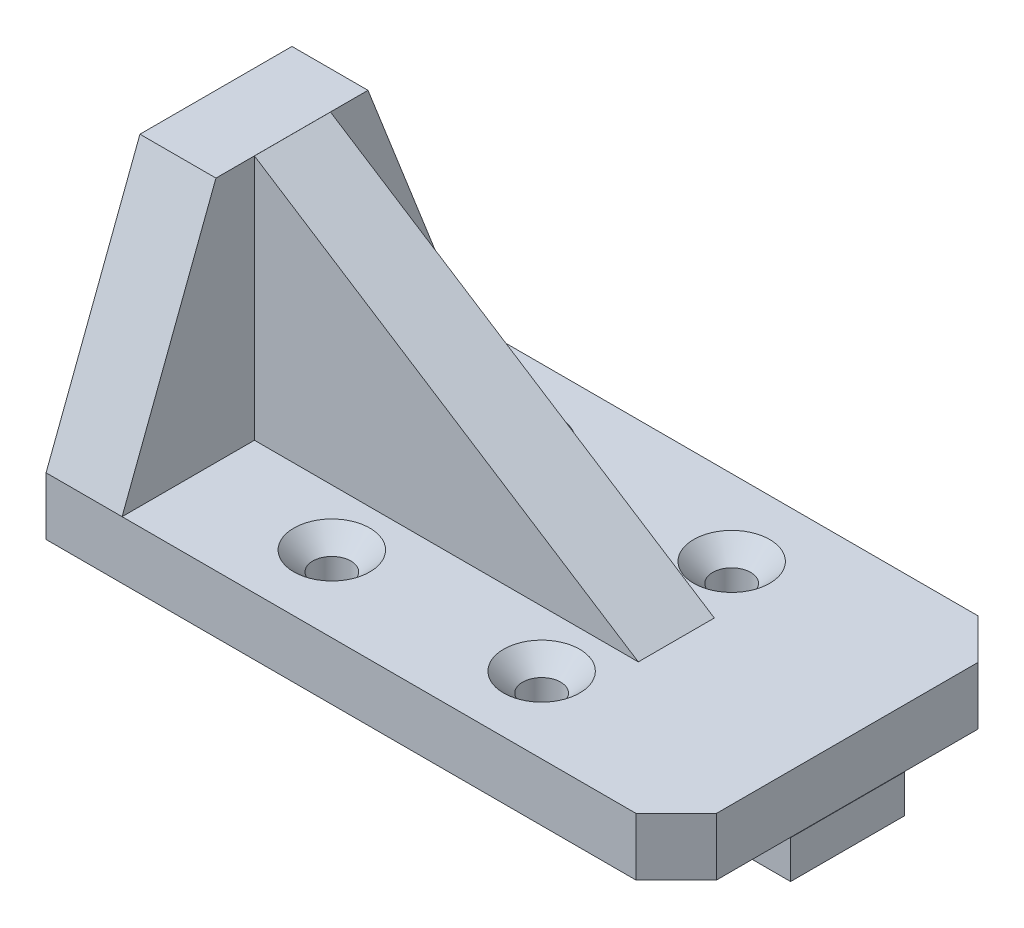
ISO-10303-21;
HEADER;
FILE_DESCRIPTION(('STEP AP214'),'2;1');
FILE_NAME('part.step','',(''),(''),'','','');
FILE_SCHEMA(('AUTOMOTIVE_DESIGN { 1 0 10303 214 1 1 1 1 }'));
ENDSEC;
DATA;
#1=APPLICATION_CONTEXT('core data for automotive mechanical design processes');
#2=APPLICATION_PROTOCOL_DEFINITION('international standard','automotive_design',2000,#1);
#3=PRODUCT_CONTEXT('',#1,'mechanical');
#4=PRODUCT('Part','Part','',(#3));
#5=PRODUCT_RELATED_PRODUCT_CATEGORY('part','',(#4));
#6=PRODUCT_DEFINITION_FORMATION('','',#4);
#7=PRODUCT_DEFINITION_CONTEXT('part definition',#1,'design');
#8=PRODUCT_DEFINITION('design','',#6,#7);
#9=PRODUCT_DEFINITION_SHAPE('','',#8);
#10=(LENGTH_UNIT() NAMED_UNIT(*) SI_UNIT(.MILLI.,.METRE.));
#11=(NAMED_UNIT(*) PLANE_ANGLE_UNIT() SI_UNIT($,.RADIAN.));
#12=(NAMED_UNIT(*) SI_UNIT($,.STERADIAN.) SOLID_ANGLE_UNIT());
#13=UNCERTAINTY_MEASURE_WITH_UNIT(LENGTH_MEASURE(1.E-05),#10,'distance_accuracy_value','');
#14=(GEOMETRIC_REPRESENTATION_CONTEXT(3) GLOBAL_UNCERTAINTY_ASSIGNED_CONTEXT((#13)) GLOBAL_UNIT_ASSIGNED_CONTEXT((#10,
#11,#12)) REPRESENTATION_CONTEXT('',''));
#15=CARTESIAN_POINT('',(0.,0.,0.));
#16=DIRECTION('',(0.,0.,1.));
#17=DIRECTION('',(1.,0.,0.));
#18=AXIS2_PLACEMENT_3D('',#15,#16,#17);
#19=CARTESIAN_POINT('',(0.,0.,0.));
#20=DIRECTION('',(0.,1.,0.));
#21=DIRECTION('',(0.,0.,1.));
#22=AXIS2_PLACEMENT_3D('',#19,#20,#21);
#23=PLANE('',#22);
#24=DIRECTION('',(-1.,0.,0.));
#25=VECTOR('',#24,1.);
#26=CARTESIAN_POINT('',(0.,0.,55.8942781690141));
#27=LINE('',#26,#25);
#28=CARTESIAN_POINT('',(-1.778,0.,55.8942781690141));
#29=VERTEX_POINT('',#28);
#30=CARTESIAN_POINT('',(-1.79049295774648,0.,55.8942781690141));
#31=VERTEX_POINT('',#30);
#32=EDGE_CURVE('E345',#29,#31,#27,.T.);
#33=ORIENTED_EDGE('',*,*,#32,.F.);
#34=DIRECTION('',(0.,0.,-1.));
#35=VECTOR('',#34,1.);
#36=CARTESIAN_POINT('',(-1.778,0.,55.8942781690141));
#37=LINE('',#36,#35);
#38=CARTESIAN_POINT('',(-1.778,0.,-1.25572183098592));
#39=VERTEX_POINT('',#38);
#40=EDGE_CURVE('E63',#29,#39,#37,.T.);
#41=ORIENTED_EDGE('',*,*,#40,.T.);
#42=DIRECTION('',(1.,0.,0.));
#43=VECTOR('',#42,1.);
#44=CARTESIAN_POINT('',(0.,0.,-1.25572183098592));
#45=LINE('',#44,#43);
#46=CARTESIAN_POINT('',(-1.79049295774648,0.,-1.25572183098592));
#47=VERTEX_POINT('',#46);
#48=EDGE_CURVE('E307',#47,#39,#45,.T.);
#49=ORIENTED_EDGE('',*,*,#48,.F.);
#50=DIRECTION('',(0.,0.,-1.));
#51=VECTOR('',#50,1.);
#52=CARTESIAN_POINT('',(-1.79049295774648,0.,0.));
#53=LINE('',#52,#51);
#54=EDGE_CURVE('E301',#31,#47,#53,.T.);
#55=ORIENTED_EDGE('',*,*,#54,.F.);
#56=EDGE_LOOP('',(#33,#41,#49,#55));
#57=FACE_BOUND('',#56,.T.);
#58=ADVANCED_FACE('F39',(#57),#23,.T.);
#59=DIRECTION('',(0.,0.,-1.));
#60=VECTOR('',#59,1.);
#61=CARTESIAN_POINT('',(10.922,0.,55.8942781690141));
#62=LINE('',#61,#60);
#63=CARTESIAN_POINT('',(10.922,0.,55.8942781690141));
#64=VERTEX_POINT('',#63);
#65=CARTESIAN_POINT('',(10.922,0.,33.782));
#66=VERTEX_POINT('',#65);
#67=EDGE_CURVE('E408',#64,#66,#62,.T.);
#68=ORIENTED_EDGE('',*,*,#67,.F.);
#69=CARTESIAN_POINT('',(96.7615070422536,0.,55.8942781690141));
#70=VERTEX_POINT('',#69);
#71=EDGE_CURVE('E346',#70,#64,#27,.T.);
#72=ORIENTED_EDGE('',*,*,#71,.F.);
#73=DIRECTION('',(-0.707106781186551,0.,0.707106781186544));
#74=VECTOR('',#73,1.);
#75=CARTESIAN_POINT('',(76.3278926056333,0.,76.3278926056341));
#76=LINE('',#75,#74);
#77=CARTESIAN_POINT('',(103.496699133055,0.,49.1590860782123));
#78=VERTEX_POINT('',#77);
#79=EDGE_CURVE('E350',#78,#70,#76,.T.);
#80=ORIENTED_EDGE('',*,*,#79,.F.);
#81=DIRECTION('',(0.,0.,1.));
#82=VECTOR('',#81,1.);
#83=CARTESIAN_POINT('',(103.496699133055,0.,0.));
#84=LINE('',#83,#82);
#85=CARTESIAN_POINT('',(103.496699133055,0.,5.47947025981595));
#86=VERTEX_POINT('',#85);
#87=EDGE_CURVE('E353',#86,#78,#84,.T.);
#88=ORIENTED_EDGE('',*,*,#87,.F.);
#89=DIRECTION('',(0.707106781186548,0.,0.707106781186548));
#90=VECTOR('',#89,1.);
#91=CARTESIAN_POINT('',(49.0086144366197,0.,-49.0086144366197));
#92=LINE('',#91,#90);
#93=CARTESIAN_POINT('',(96.7615070422535,0.,-1.25572183098591));
#94=VERTEX_POINT('',#93);
#95=EDGE_CURVE('E356',#94,#86,#92,.T.);
#96=ORIENTED_EDGE('',*,*,#95,.F.);
#97=CARTESIAN_POINT('',(10.922,0.,-1.25572183098592));
#98=VERTEX_POINT('',#97);
#99=EDGE_CURVE('E55',#98,#94,#45,.T.);
#100=ORIENTED_EDGE('',*,*,#99,.F.);
#101=CARTESIAN_POINT('',(10.922,0.,21.082));
#102=VERTEX_POINT('',#101);
#103=EDGE_CURVE('E185',#102,#98,#62,.T.);
#104=ORIENTED_EDGE('',*,*,#103,.F.);
#105=DIRECTION('',(1.,0.,0.));
#106=VECTOR('',#105,1.);
#107=CARTESIAN_POINT('',(75.0486991330554,0.,21.082));
#108=LINE('',#107,#106);
#109=CARTESIAN_POINT('',(75.0486991330554,0.,21.082));
#110=VERTEX_POINT('',#109);
#111=EDGE_CURVE('E206',#102,#110,#108,.T.);
#112=ORIENTED_EDGE('',*,*,#111,.T.);
#113=DIRECTION('',(0.,0.,-1.));
#114=VECTOR('',#113,1.);
#115=CARTESIAN_POINT('',(75.0486991330554,0.,33.782));
#116=LINE('',#115,#114);
#117=CARTESIAN_POINT('',(75.0486991330554,0.,33.782));
#118=VERTEX_POINT('',#117);
#119=EDGE_CURVE('E215',#118,#110,#116,.T.);
#120=ORIENTED_EDGE('',*,*,#119,.F.);
#121=DIRECTION('',(1.,0.,0.));
#122=VECTOR('',#121,1.);
#123=CARTESIAN_POINT('',(75.0486991330554,0.,33.782));
#124=LINE('',#123,#122);
#125=EDGE_CURVE('E207',#66,#118,#124,.T.);
#126=ORIENTED_EDGE('',*,*,#125,.F.);
#127=EDGE_LOOP('',(#68,#72,#80,#88,#96,#100,#104,#112,#120,#126));
#128=FACE_BOUND('',#127,.T.);
#129=CARTESIAN_POINT('',(68.3135070422535,0.,11.4442781690141));
#130=DIRECTION('',(0.,1.,0.));
#131=DIRECTION('',(0.,0.,1.));
#132=AXIS2_PLACEMENT_3D('',#129,#130,#131);
#133=CIRCLE('',#132,6.35);
#134=CARTESIAN_POINT('',(68.3135070422535,0.,17.7942781690141));
#135=VERTEX_POINT('',#134);
#136=EDGE_CURVE('E269',#135,#135,#133,.T.);
#137=ORIENTED_EDGE('',*,*,#136,.F.);
#138=EDGE_LOOP('',(#137));
#139=FACE_BOUND('',#138,.T.);
#140=CARTESIAN_POINT('',(33.2615070422535,0.,11.4442781690141));
#141=DIRECTION('',(0.,1.,0.));
#142=DIRECTION('',(0.,0.,1.));
#143=AXIS2_PLACEMENT_3D('',#140,#141,#142);
#144=CIRCLE('',#143,6.35);
#145=CARTESIAN_POINT('',(33.2615070422535,0.,17.7942781690141));
#146=VERTEX_POINT('',#145);
#147=EDGE_CURVE('E275',#146,#146,#144,.T.);
#148=ORIENTED_EDGE('',*,*,#147,.F.);
#149=EDGE_LOOP('',(#148));
#150=FACE_BOUND('',#149,.T.);
#151=CARTESIAN_POINT('',(33.2615070422535,0.,43.1942781690141));
#152=DIRECTION('',(0.,1.,0.));
#153=DIRECTION('',(0.,0.,1.));
#154=AXIS2_PLACEMENT_3D('',#151,#152,#153);
#155=CIRCLE('',#154,6.35);
#156=CARTESIAN_POINT('',(33.2615070422535,0.,49.5442781690141));
#157=VERTEX_POINT('',#156);
#158=EDGE_CURVE('E270',#157,#157,#155,.T.);
#159=ORIENTED_EDGE('',*,*,#158,.F.);
#160=EDGE_LOOP('',(#159));
#161=FACE_BOUND('',#160,.T.);
#162=CARTESIAN_POINT('',(68.3135070422535,0.,43.194278169014));
#163=DIRECTION('',(0.,1.,0.));
#164=DIRECTION('',(0.,0.,1.));
#165=AXIS2_PLACEMENT_3D('',#162,#163,#164);
#166=CIRCLE('',#165,6.35);
#167=CARTESIAN_POINT('',(68.3135070422535,0.,49.544278169014));
#168=VERTEX_POINT('',#167);
#169=EDGE_CURVE('E274',#168,#168,#166,.T.);
#170=ORIENTED_EDGE('',*,*,#169,.F.);
#171=EDGE_LOOP('',(#170));
#172=FACE_BOUND('',#171,.T.);
#173=ADVANCED_FACE('F403',(#128,#139,#150,#161,#172),#23,.T.);
#174=CARTESIAN_POINT('',(0.,-9.652,0.));
#175=DIRECTION('',(0.,1.,0.));
#176=DIRECTION('',(0.,0.,1.));
#177=AXIS2_PLACEMENT_3D('',#174,#175,#176);
#178=PLANE('',#177);
#179=CARTESIAN_POINT('',(68.3135070422535,-9.652,43.194278169014));
#180=DIRECTION('',(0.,1.,0.));
#181=DIRECTION('',(0.,0.,1.));
#182=AXIS2_PLACEMENT_3D('',#179,#180,#181);
#183=CIRCLE('',#182,3.175);
#184=CARTESIAN_POINT('',(68.3135070422535,-9.652,46.369278169014));
#185=VERTEX_POINT('',#184);
#186=EDGE_CURVE('E337',#185,#185,#183,.T.);
#187=ORIENTED_EDGE('',*,*,#186,.T.);
#188=EDGE_LOOP('',(#187));
#189=FACE_BOUND('',#188,.T.);
#190=CARTESIAN_POINT('',(33.2615070422535,-9.652,43.1942781690141));
#191=DIRECTION('',(0.,1.,0.));
#192=DIRECTION('',(0.,0.,1.));
#193=AXIS2_PLACEMENT_3D('',#190,#191,#192);
#194=CIRCLE('',#193,3.175);
#195=CARTESIAN_POINT('',(33.2615070422535,-9.652,46.3692781690141));
#196=VERTEX_POINT('',#195);
#197=EDGE_CURVE('E333',#196,#196,#194,.T.);
#198=ORIENTED_EDGE('',*,*,#197,.T.);
#199=EDGE_LOOP('',(#198));
#200=FACE_BOUND('',#199,.T.);
#201=CARTESIAN_POINT('',(68.3135070422535,-9.652,11.4442781690141));
#202=DIRECTION('',(0.,1.,0.));
#203=DIRECTION('',(0.,0.,1.));
#204=AXIS2_PLACEMENT_3D('',#201,#202,#203);
#205=CIRCLE('',#204,3.175);
#206=CARTESIAN_POINT('',(68.3135070422535,-9.652,14.6192781690141));
#207=VERTEX_POINT('',#206);
#208=EDGE_CURVE('E329',#207,#207,#205,.T.);
#209=ORIENTED_EDGE('',*,*,#208,.T.);
#210=EDGE_LOOP('',(#209));
#211=FACE_BOUND('',#210,.T.);
#212=CARTESIAN_POINT('',(33.2615070422535,-9.652,11.4442781690141));
#213=DIRECTION('',(0.,1.,0.));
#214=DIRECTION('',(0.,0.,1.));
#215=AXIS2_PLACEMENT_3D('',#212,#213,#214);
#216=CIRCLE('',#215,3.175);
#217=CARTESIAN_POINT('',(33.2615070422535,-9.652,14.6192781690141));
#218=VERTEX_POINT('',#217);
#219=EDGE_CURVE('E325',#218,#218,#216,.T.);
#220=ORIENTED_EDGE('',*,*,#219,.T.);
#221=EDGE_LOOP('',(#220));
#222=FACE_BOUND('',#221,.T.);
#223=DIRECTION('',(-1.,0.,0.));
#224=VECTOR('',#223,1.);
#225=CARTESIAN_POINT('',(103.55569205,-9.652,36.8442781690141));
#226=LINE('',#225,#224);
#227=CARTESIAN_POINT('',(103.496699133055,-9.652,36.8442781690141));
#228=VERTEX_POINT('',#227);
#229=CARTESIAN_POINT('',(-1.778,-9.652,36.8442781690141));
#230=VERTEX_POINT('',#229);
#231=EDGE_CURVE('E48',#228,#230,#226,.T.);
#232=ORIENTED_EDGE('',*,*,#231,.F.);
#233=DIRECTION('',(0.,0.,1.));
#234=VECTOR('',#233,1.);
#235=CARTESIAN_POINT('',(103.496699133055,-9.652,0.));
#236=LINE('',#235,#234);
#237=CARTESIAN_POINT('',(103.496699133055,-9.652,49.1590860782123));
#238=VERTEX_POINT('',#237);
#239=EDGE_CURVE('E313',#228,#238,#236,.T.);
#240=ORIENTED_EDGE('',*,*,#239,.T.);
#241=DIRECTION('',(-0.707106781186551,0.,0.707106781186544));
#242=VECTOR('',#241,1.);
#243=CARTESIAN_POINT('',(76.3278926056333,-9.652,76.3278926056341));
#244=LINE('',#243,#242);
#245=CARTESIAN_POINT('',(96.7615070422536,-9.652,55.8942781690141));
#246=VERTEX_POINT('',#245);
#247=EDGE_CURVE('E310',#238,#246,#244,.T.);
#248=ORIENTED_EDGE('',*,*,#247,.T.);
#249=DIRECTION('',(-1.,0.,0.));
#250=VECTOR('',#249,1.);
#251=CARTESIAN_POINT('',(0.,-9.652,55.8942781690141));
#252=LINE('',#251,#250);
#253=CARTESIAN_POINT('',(-1.79049295774648,-9.652,55.8942781690141));
#254=VERTEX_POINT('',#253);
#255=EDGE_CURVE('E306',#246,#254,#252,.T.);
#256=ORIENTED_EDGE('',*,*,#255,.T.);
#257=DIRECTION('',(0.,0.,-1.));
#258=VECTOR('',#257,1.);
#259=CARTESIAN_POINT('',(-1.79049295774648,-9.652,0.));
#260=LINE('',#259,#258);
#261=CARTESIAN_POINT('',(-1.79049295774648,-9.652,-1.25572183098592));
#262=VERTEX_POINT('',#261);
#263=EDGE_CURVE('E302',#254,#262,#260,.T.);
#264=ORIENTED_EDGE('',*,*,#263,.T.);
#265=DIRECTION('',(1.,0.,0.));
#266=VECTOR('',#265,1.);
#267=CARTESIAN_POINT('',(0.,-9.652,-1.25572183098592));
#268=LINE('',#267,#266);
#269=CARTESIAN_POINT('',(96.7615070422535,-9.652,-1.25572183098591));
#270=VERTEX_POINT('',#269);
#271=EDGE_CURVE('E322',#262,#270,#268,.T.);
#272=ORIENTED_EDGE('',*,*,#271,.T.);
#273=DIRECTION('',(0.707106781186548,0.,0.707106781186548));
#274=VECTOR('',#273,1.);
#275=CARTESIAN_POINT('',(49.0086144366197,-9.652,-49.0086144366197));
#276=LINE('',#275,#274);
#277=CARTESIAN_POINT('',(103.496699133055,-9.652,5.47947025981595));
#278=VERTEX_POINT('',#277);
#279=EDGE_CURVE('E318',#270,#278,#276,.T.);
#280=ORIENTED_EDGE('',*,*,#279,.T.);
#281=CARTESIAN_POINT('',(103.496699133055,-9.652,17.7942781690141));
#282=VERTEX_POINT('',#281);
#283=EDGE_CURVE('E314',#278,#282,#236,.T.);
#284=ORIENTED_EDGE('',*,*,#283,.T.);
#285=DIRECTION('',(-1.,0.,0.));
#286=VECTOR('',#285,1.);
#287=CARTESIAN_POINT('',(103.55569205,-9.652,17.7942781690141));
#288=LINE('',#287,#286);
#289=CARTESIAN_POINT('',(-1.778,-9.652,17.7942781690141));
#290=VERTEX_POINT('',#289);
#291=EDGE_CURVE('E261',#282,#290,#288,.T.);
#292=ORIENTED_EDGE('',*,*,#291,.T.);
#293=DIRECTION('',(0.,0.,1.));
#294=VECTOR('',#293,1.);
#295=CARTESIAN_POINT('',(-1.778,-9.652,36.8442781690141));
#296=LINE('',#295,#294);
#297=EDGE_CURVE('E230',#290,#230,#296,.T.);
#298=ORIENTED_EDGE('',*,*,#297,.T.);
#299=EDGE_LOOP('',(#232,#240,#248,#256,#264,#272,#280,#284,#292,#298));
#300=FACE_BOUND('',#299,.T.);
#301=ADVANCED_FACE('F396',(#189,#200,#211,#222,#300),#178,.F.);
#302=CARTESIAN_POINT('',(-1.79049295774648,-9.652,0.));
#303=DIRECTION('',(1.,0.,0.));
#304=DIRECTION('',(0.,0.,-1.));
#305=AXIS2_PLACEMENT_3D('',#302,#303,#304);
#306=PLANE('',#305);
#307=ORIENTED_EDGE('',*,*,#54,.T.);
#308=DIRECTION('',(0.,1.,0.));
#309=VECTOR('',#308,1.);
#310=CARTESIAN_POINT('',(-1.79049295774648,-9.652,-1.25572183098592));
#311=LINE('',#310,#309);
#312=EDGE_CURVE('E361',#262,#47,#311,.T.);
#313=ORIENTED_EDGE('',*,*,#312,.F.);
#314=ORIENTED_EDGE('',*,*,#263,.F.);
#315=DIRECTION('',(0.,1.,0.));
#316=VECTOR('',#315,1.);
#317=CARTESIAN_POINT('',(-1.79049295774648,-9.652,55.8942781690141));
#318=LINE('',#317,#316);
#319=EDGE_CURVE('E341',#254,#31,#318,.T.);
#320=ORIENTED_EDGE('',*,*,#319,.T.);
#321=EDGE_LOOP('',(#307,#313,#314,#320));
#322=FACE_BOUND('',#321,.T.);
#323=ADVANCED_FACE('F41',(#322),#306,.F.);
#324=CARTESIAN_POINT('',(0.,-9.652,-1.25572183098592));
#325=DIRECTION('',(0.,0.,1.));
#326=DIRECTION('',(1.,0.,0.));
#327=AXIS2_PLACEMENT_3D('',#324,#325,#326);
#328=PLANE('',#327);
#329=ORIENTED_EDGE('',*,*,#48,.T.);
#330=DIRECTION('',(-1.,0.,0.));
#331=VECTOR('',#330,1.);
#332=CARTESIAN_POINT('',(10.922,0.,-1.25572183098592));
#333=LINE('',#332,#331);
#334=EDGE_CURVE('E411',#98,#39,#333,.T.);
#335=ORIENTED_EDGE('',*,*,#334,.F.);
#336=ORIENTED_EDGE('',*,*,#99,.T.);
#337=DIRECTION('',(0.,1.,0.));
#338=VECTOR('',#337,1.);
#339=CARTESIAN_POINT('',(96.7615070422535,-9.652,-1.25572183098591));
#340=LINE('',#339,#338);
#341=EDGE_CURVE('E365',#270,#94,#340,.T.);
#342=ORIENTED_EDGE('',*,*,#341,.F.);
#343=ORIENTED_EDGE('',*,*,#271,.F.);
#344=ORIENTED_EDGE('',*,*,#312,.T.);
#345=EDGE_LOOP('',(#329,#335,#336,#342,#343,#344));
#346=FACE_BOUND('',#345,.T.);
#347=ADVANCED_FACE('F391',(#346),#328,.F.);
#348=CARTESIAN_POINT('',(49.0086144366197,-9.652,-49.0086144366197));
#349=DIRECTION('',(-0.707106781186547,0.,0.707106781186547));
#350=DIRECTION('',(0.707106781186548,0.,0.707106781186548));
#351=AXIS2_PLACEMENT_3D('',#348,#349,#350);
#352=PLANE('',#351);
#353=ORIENTED_EDGE('',*,*,#95,.T.);
#354=DIRECTION('',(0.,1.,0.));
#355=VECTOR('',#354,1.);
#356=CARTESIAN_POINT('',(103.496699133055,-9.652,5.47947025981595));
#357=LINE('',#356,#355);
#358=EDGE_CURVE('E369',#278,#86,#357,.T.);
#359=ORIENTED_EDGE('',*,*,#358,.F.);
#360=ORIENTED_EDGE('',*,*,#279,.F.);
#361=ORIENTED_EDGE('',*,*,#341,.T.);
#362=EDGE_LOOP('',(#353,#359,#360,#361));
#363=FACE_BOUND('',#362,.T.);
#364=ADVANCED_FACE('F471',(#363),#352,.F.);
#365=CARTESIAN_POINT('',(103.496699133055,-9.652,0.));
#366=DIRECTION('',(-1.,0.,0.));
#367=DIRECTION('',(0.,0.,1.));
#368=AXIS2_PLACEMENT_3D('',#365,#366,#367);
#369=PLANE('',#368);
#370=ORIENTED_EDGE('',*,*,#87,.T.);
#371=DIRECTION('',(0.,1.,0.));
#372=VECTOR('',#371,1.);
#373=CARTESIAN_POINT('',(103.496699133055,-9.652,49.1590860782123));
#374=LINE('',#373,#372);
#375=EDGE_CURVE('E373',#238,#78,#374,.T.);
#376=ORIENTED_EDGE('',*,*,#375,.F.);
#377=ORIENTED_EDGE('',*,*,#239,.F.);
#378=EDGE_CURVE('E319',#282,#228,#236,.T.);
#379=ORIENTED_EDGE('',*,*,#378,.F.);
#380=ORIENTED_EDGE('',*,*,#283,.F.);
#381=ORIENTED_EDGE('',*,*,#358,.T.);
#382=EDGE_LOOP('',(#370,#376,#377,#379,#380,#381));
#383=FACE_BOUND('',#382,.T.);
#384=ADVANCED_FACE('F474',(#383),#369,.F.);
#385=CARTESIAN_POINT('',(76.3278926056333,-9.652,76.3278926056341));
#386=DIRECTION('',(-0.707106781186544,0.,-0.707106781186551));
#387=DIRECTION('',(-0.707106781186551,0.,0.707106781186544));
#388=AXIS2_PLACEMENT_3D('',#385,#386,#387);
#389=PLANE('',#388);
#390=ORIENTED_EDGE('',*,*,#79,.T.);
#391=DIRECTION('',(0.,1.,0.));
#392=VECTOR('',#391,1.);
#393=CARTESIAN_POINT('',(96.7615070422536,-9.652,55.8942781690141));
#394=LINE('',#393,#392);
#395=EDGE_CURVE('E377',#246,#70,#394,.T.);
#396=ORIENTED_EDGE('',*,*,#395,.F.);
#397=ORIENTED_EDGE('',*,*,#247,.F.);
#398=ORIENTED_EDGE('',*,*,#375,.T.);
#399=EDGE_LOOP('',(#390,#396,#397,#398));
#400=FACE_BOUND('',#399,.T.);
#401=ADVANCED_FACE('F460',(#400),#389,.F.);
#402=CARTESIAN_POINT('',(33.2615070422535,-9.652,43.1942781690141));
#403=DIRECTION('',(0.,1.,0.));
#404=DIRECTION('',(0.,0.,1.));
#405=AXIS2_PLACEMENT_3D('',#402,#403,#404);
#406=CYLINDRICAL_SURFACE('',#405,3.175);
#407=CARTESIAN_POINT('',(33.2615070422535,-3.17499999999999,43.1942781690141));
#408=DIRECTION('',(0.,1.,0.));
#409=DIRECTION('',(0.,0.,1.));
#410=AXIS2_PLACEMENT_3D('',#407,#408,#409);
#411=CIRCLE('',#410,3.175);
#412=CARTESIAN_POINT('',(33.2615070422535,-3.17499999999999,46.3692781690141));
#413=VERTEX_POINT('',#412);
#414=EDGE_CURVE('E289',#413,#413,#411,.T.);
#415=ORIENTED_EDGE('',*,*,#414,.T.);
#416=EDGE_LOOP('',(#415));
#417=FACE_BOUND('',#416,.T.);
#418=ORIENTED_EDGE('',*,*,#197,.F.);
#419=EDGE_LOOP('',(#418));
#420=FACE_BOUND('',#419,.T.);
#421=ADVANCED_FACE('F456',(#417,#420),#406,.F.);
#422=CARTESIAN_POINT('',(68.3135070422535,-9.652,11.4442781690141));
#423=DIRECTION('',(0.,1.,0.));
#424=DIRECTION('',(0.,0.,1.));
#425=AXIS2_PLACEMENT_3D('',#422,#423,#424);
#426=CYLINDRICAL_SURFACE('',#425,3.175);
#427=CARTESIAN_POINT('',(68.3135070422535,-3.17499999999999,11.4442781690141));
#428=DIRECTION('',(0.,1.,0.));
#429=DIRECTION('',(0.,0.,1.));
#430=AXIS2_PLACEMENT_3D('',#427,#428,#429);
#431=CIRCLE('',#430,3.175);
#432=CARTESIAN_POINT('',(68.3135070422535,-3.17499999999999,14.6192781690141));
#433=VERTEX_POINT('',#432);
#434=EDGE_CURVE('E297',#433,#433,#431,.T.);
#435=ORIENTED_EDGE('',*,*,#434,.T.);
#436=EDGE_LOOP('',(#435));
#437=FACE_BOUND('',#436,.T.);
#438=ORIENTED_EDGE('',*,*,#208,.F.);
#439=EDGE_LOOP('',(#438));
#440=FACE_BOUND('',#439,.T.);
#441=ADVANCED_FACE('F459',(#437,#440),#426,.F.);
#442=CARTESIAN_POINT('',(33.2615070422535,-9.652,11.4442781690141));
#443=DIRECTION('',(0.,1.,0.));
#444=DIRECTION('',(0.,0.,1.));
#445=AXIS2_PLACEMENT_3D('',#442,#443,#444);
#446=CYLINDRICAL_SURFACE('',#445,3.175);
#447=CARTESIAN_POINT('',(33.2615070422535,-3.17499999999999,11.4442781690141));
#448=DIRECTION('',(0.,1.,0.));
#449=DIRECTION('',(0.,0.,1.));
#450=AXIS2_PLACEMENT_3D('',#447,#448,#449);
#451=CIRCLE('',#450,3.175);
#452=CARTESIAN_POINT('',(33.2615070422535,-3.17499999999999,14.6192781690141));
#453=VERTEX_POINT('',#452);
#454=EDGE_CURVE('E293',#453,#453,#451,.T.);
#455=ORIENTED_EDGE('',*,*,#454,.T.);
#456=EDGE_LOOP('',(#455));
#457=FACE_BOUND('',#456,.T.);
#458=ORIENTED_EDGE('',*,*,#219,.F.);
#459=EDGE_LOOP('',(#458));
#460=FACE_BOUND('',#459,.T.);
#461=ADVANCED_FACE('F464',(#457,#460),#446,.F.);
#462=CARTESIAN_POINT('',(0.,-9.652,55.8942781690141));
#463=DIRECTION('',(0.,0.,-1.));
#464=DIRECTION('',(-1.,0.,0.));
#465=AXIS2_PLACEMENT_3D('',#462,#463,#464);
#466=PLANE('',#465);
#467=ORIENTED_EDGE('',*,*,#71,.T.);
#468=DIRECTION('',(-1.,0.,0.));
#469=VECTOR('',#468,1.);
#470=CARTESIAN_POINT('',(10.922,0.,55.8942781690141));
#471=LINE('',#470,#469);
#472=EDGE_CURVE('E200',#64,#29,#471,.T.);
#473=ORIENTED_EDGE('',*,*,#472,.T.);
#474=ORIENTED_EDGE('',*,*,#32,.T.);
#475=ORIENTED_EDGE('',*,*,#319,.F.);
#476=ORIENTED_EDGE('',*,*,#255,.F.);
#477=ORIENTED_EDGE('',*,*,#395,.T.);
#478=EDGE_LOOP('',(#467,#473,#474,#475,#476,#477));
#479=FACE_BOUND('',#478,.T.);
#480=ADVANCED_FACE('F399',(#479),#466,.F.);
#481=CARTESIAN_POINT('',(68.3135070422535,-9.652,43.194278169014));
#482=DIRECTION('',(0.,1.,0.));
#483=DIRECTION('',(0.,0.,1.));
#484=AXIS2_PLACEMENT_3D('',#481,#482,#483);
#485=CYLINDRICAL_SURFACE('',#484,3.175);
#486=CARTESIAN_POINT('',(68.3135070422535,-3.17499999999999,43.194278169014));
#487=DIRECTION('',(0.,1.,0.));
#488=DIRECTION('',(0.,0.,1.));
#489=AXIS2_PLACEMENT_3D('',#486,#487,#488);
#490=CIRCLE('',#489,3.175);
#491=CARTESIAN_POINT('',(68.3135070422535,-3.17499999999999,46.369278169014));
#492=VERTEX_POINT('',#491);
#493=EDGE_CURVE('E285',#492,#492,#490,.T.);
#494=ORIENTED_EDGE('',*,*,#493,.T.);
#495=EDGE_LOOP('',(#494));
#496=FACE_BOUND('',#495,.T.);
#497=ORIENTED_EDGE('',*,*,#186,.F.);
#498=EDGE_LOOP('',(#497));
#499=FACE_BOUND('',#498,.T.);
#500=ADVANCED_FACE('F451',(#496,#499),#485,.F.);
#501=CARTESIAN_POINT('',(68.3135070422535,0.,43.194278169014));
#502=DIRECTION('',(0.,1.,0.));
#503=DIRECTION('',(0.,0.,1.));
#504=AXIS2_PLACEMENT_3D('',#501,#502,#503);
#505=CONICAL_SURFACE('',#504,6.35,0.78539816339745);
#506=ORIENTED_EDGE('',*,*,#169,.T.);
#507=EDGE_LOOP('',(#506));
#508=FACE_BOUND('',#507,.T.);
#509=ORIENTED_EDGE('',*,*,#493,.F.);
#510=EDGE_LOOP('',(#509));
#511=FACE_BOUND('',#510,.T.);
#512=ADVANCED_FACE('F454',(#508,#511),#505,.F.);
#513=CARTESIAN_POINT('',(33.2615070422535,0.,43.1942781690141));
#514=DIRECTION('',(0.,1.,0.));
#515=DIRECTION('',(0.,0.,1.));
#516=AXIS2_PLACEMENT_3D('',#513,#514,#515);
#517=CONICAL_SURFACE('',#516,6.35,0.78539816339745);
#518=ORIENTED_EDGE('',*,*,#158,.T.);
#519=EDGE_LOOP('',(#518));
#520=FACE_BOUND('',#519,.T.);
#521=ORIENTED_EDGE('',*,*,#414,.F.);
#522=EDGE_LOOP('',(#521));
#523=FACE_BOUND('',#522,.T.);
#524=ADVANCED_FACE('F572',(#520,#523),#517,.F.);
#525=CARTESIAN_POINT('',(33.2615070422535,0.,11.4442781690141));
#526=DIRECTION('',(0.,1.,0.));
#527=DIRECTION('',(0.,0.,1.));
#528=AXIS2_PLACEMENT_3D('',#525,#526,#527);
#529=CONICAL_SURFACE('',#528,6.35,0.78539816339745);
#530=ORIENTED_EDGE('',*,*,#147,.T.);
#531=EDGE_LOOP('',(#530));
#532=FACE_BOUND('',#531,.T.);
#533=ORIENTED_EDGE('',*,*,#454,.F.);
#534=EDGE_LOOP('',(#533));
#535=FACE_BOUND('',#534,.T.);
#536=ADVANCED_FACE('F575',(#532,#535),#529,.F.);
#537=CARTESIAN_POINT('',(68.3135070422535,0.,11.4442781690141));
#538=DIRECTION('',(0.,1.,0.));
#539=DIRECTION('',(0.,0.,1.));
#540=AXIS2_PLACEMENT_3D('',#537,#538,#539);
#541=CONICAL_SURFACE('',#540,6.35,0.78539816339745);
#542=ORIENTED_EDGE('',*,*,#136,.T.);
#543=EDGE_LOOP('',(#542));
#544=FACE_BOUND('',#543,.T.);
#545=ORIENTED_EDGE('',*,*,#434,.F.);
#546=EDGE_LOOP('',(#545));
#547=FACE_BOUND('',#546,.T.);
#548=ADVANCED_FACE('F560',(#544,#547),#541,.F.);
#549=CARTESIAN_POINT('',(103.55569205,-9.652,36.8442781690141));
#550=DIRECTION('',(0.,-1.,0.));
#551=DIRECTION('',(0.,0.,-1.));
#552=AXIS2_PLACEMENT_3D('',#549,#550,#551);
#553=PLANE('',#552);
#554=CARTESIAN_POINT('',(103.55569205,-9.652,17.7942781690141));
#555=VERTEX_POINT('',#554);
#556=EDGE_CURVE('E256',#555,#282,#288,.T.);
#557=ORIENTED_EDGE('',*,*,#556,.T.);
#558=ORIENTED_EDGE('',*,*,#378,.T.);
#559=CARTESIAN_POINT('',(103.55569205,-9.652,36.8442781690141));
#560=VERTEX_POINT('',#559);
#561=EDGE_CURVE('E239',#560,#228,#226,.T.);
#562=ORIENTED_EDGE('',*,*,#561,.F.);
#563=DIRECTION('',(0.,0.,1.));
#564=VECTOR('',#563,1.);
#565=CARTESIAN_POINT('',(103.55569205,-9.652,36.8442781690141));
#566=LINE('',#565,#564);
#567=EDGE_CURVE('E236',#555,#560,#566,.T.);
#568=ORIENTED_EDGE('',*,*,#567,.F.);
#569=EDGE_LOOP('',(#557,#558,#562,#568));
#570=FACE_BOUND('',#569,.T.);
#571=ADVANCED_FACE('F556',(#570),#553,.F.);
#572=CARTESIAN_POINT('',(103.55569205,-9.652,36.8442781690141));
#573=DIRECTION('',(0.,0.,-1.));
#574=DIRECTION('',(-1.,0.,0.));
#575=AXIS2_PLACEMENT_3D('',#572,#573,#574);
#576=PLANE('',#575);
#577=DIRECTION('',(0.,-1.,0.));
#578=VECTOR('',#577,1.);
#579=CARTESIAN_POINT('',(-1.778,-9.652,36.8442781690141));
#580=LINE('',#579,#578);
#581=CARTESIAN_POINT('',(-1.778,-16.002,36.8442781690141));
#582=VERTEX_POINT('',#581);
#583=EDGE_CURVE('E224',#230,#582,#580,.T.);
#584=ORIENTED_EDGE('',*,*,#583,.T.);
#585=DIRECTION('',(-1.,0.,0.));
#586=VECTOR('',#585,1.);
#587=CARTESIAN_POINT('',(103.55569205,-16.002,36.8442781690141));
#588=LINE('',#587,#586);
#589=CARTESIAN_POINT('',(103.55569205,-16.002,36.8442781690141));
#590=VERTEX_POINT('',#589);
#591=EDGE_CURVE('E265',#590,#582,#588,.T.);
#592=ORIENTED_EDGE('',*,*,#591,.F.);
#593=DIRECTION('',(0.,-1.,0.));
#594=VECTOR('',#593,1.);
#595=CARTESIAN_POINT('',(103.55569205,-9.652,36.8442781690141));
#596=LINE('',#595,#594);
#597=EDGE_CURVE('E225',#560,#590,#596,.T.);
#598=ORIENTED_EDGE('',*,*,#597,.F.);
#599=ORIENTED_EDGE('',*,*,#561,.T.);
#600=ORIENTED_EDGE('',*,*,#231,.T.);
#601=EDGE_LOOP('',(#584,#592,#598,#599,#600));
#602=FACE_BOUND('',#601,.T.);
#603=ADVANCED_FACE('F559',(#602),#576,.F.);
#604=CARTESIAN_POINT('',(103.55569205,-16.002,36.8442781690141));
#605=DIRECTION('',(0.,1.,0.));
#606=DIRECTION('',(0.,0.,1.));
#607=AXIS2_PLACEMENT_3D('',#604,#605,#606);
#608=PLANE('',#607);
#609=DIRECTION('',(0.,0.,-1.));
#610=VECTOR('',#609,1.);
#611=CARTESIAN_POINT('',(-1.778,-16.002,36.8442781690141));
#612=LINE('',#611,#610);
#613=CARTESIAN_POINT('',(-1.778,-16.002,17.7942781690141));
#614=VERTEX_POINT('',#613);
#615=EDGE_CURVE('E243',#582,#614,#612,.T.);
#616=ORIENTED_EDGE('',*,*,#615,.T.);
#617=DIRECTION('',(-1.,0.,0.));
#618=VECTOR('',#617,1.);
#619=CARTESIAN_POINT('',(103.55569205,-16.002,17.7942781690141));
#620=LINE('',#619,#618);
#621=CARTESIAN_POINT('',(103.55569205,-16.002,17.7942781690141));
#622=VERTEX_POINT('',#621);
#623=EDGE_CURVE('E260',#622,#614,#620,.T.);
#624=ORIENTED_EDGE('',*,*,#623,.F.);
#625=DIRECTION('',(0.,0.,-1.));
#626=VECTOR('',#625,1.);
#627=CARTESIAN_POINT('',(103.55569205,-16.002,36.8442781690141));
#628=LINE('',#627,#626);
#629=EDGE_CURVE('E229',#590,#622,#628,.T.);
#630=ORIENTED_EDGE('',*,*,#629,.F.);
#631=ORIENTED_EDGE('',*,*,#591,.T.);
#632=EDGE_LOOP('',(#616,#624,#630,#631));
#633=FACE_BOUND('',#632,.T.);
#634=ADVANCED_FACE('F564',(#633),#608,.F.);
#635=CARTESIAN_POINT('',(103.55569205,-9.652,17.7942781690141));
#636=DIRECTION('',(0.,0.,1.));
#637=DIRECTION('',(1.,0.,0.));
#638=AXIS2_PLACEMENT_3D('',#635,#636,#637);
#639=PLANE('',#638);
#640=DIRECTION('',(0.,1.,0.));
#641=VECTOR('',#640,1.);
#642=CARTESIAN_POINT('',(-1.778,-9.652,17.7942781690141));
#643=LINE('',#642,#641);
#644=EDGE_CURVE('E246',#614,#290,#643,.T.);
#645=ORIENTED_EDGE('',*,*,#644,.T.);
#646=ORIENTED_EDGE('',*,*,#291,.F.);
#647=ORIENTED_EDGE('',*,*,#556,.F.);
#648=DIRECTION('',(0.,1.,0.));
#649=VECTOR('',#648,1.);
#650=CARTESIAN_POINT('',(103.55569205,-9.652,17.7942781690141));
#651=LINE('',#650,#649);
#652=EDGE_CURVE('E233',#622,#555,#651,.T.);
#653=ORIENTED_EDGE('',*,*,#652,.F.);
#654=ORIENTED_EDGE('',*,*,#623,.T.);
#655=EDGE_LOOP('',(#645,#646,#647,#653,#654));
#656=FACE_BOUND('',#655,.T.);
#657=ADVANCED_FACE('F551',(#656),#639,.F.);
#658=CARTESIAN_POINT('',(103.55569205,0.,0.));
#659=DIRECTION('',(1.,0.,0.));
#660=DIRECTION('',(0.,0.,-1.));
#661=AXIS2_PLACEMENT_3D('',#658,#659,#660);
#662=PLANE('',#661);
#663=ORIENTED_EDGE('',*,*,#597,.T.);
#664=ORIENTED_EDGE('',*,*,#629,.T.);
#665=ORIENTED_EDGE('',*,*,#652,.T.);
#666=ORIENTED_EDGE('',*,*,#567,.T.);
#667=EDGE_LOOP('',(#663,#664,#665,#666));
#668=FACE_BOUND('',#667,.T.);
#669=ADVANCED_FACE('F548',(#668),#662,.T.);
#670=CARTESIAN_POINT('',(-1.778,0.,0.));
#671=DIRECTION('',(1.,0.,0.));
#672=DIRECTION('',(0.,0.,-1.));
#673=AXIS2_PLACEMENT_3D('',#670,#671,#672);
#674=PLANE('',#673);
#675=ORIENTED_EDGE('',*,*,#583,.F.);
#676=ORIENTED_EDGE('',*,*,#297,.F.);
#677=ORIENTED_EDGE('',*,*,#644,.F.);
#678=ORIENTED_EDGE('',*,*,#615,.F.);
#679=EDGE_LOOP('',(#675,#676,#677,#678));
#680=FACE_BOUND('',#679,.T.);
#681=ADVANCED_FACE('F493',(#680),#674,.F.);
#682=CARTESIAN_POINT('',(10.9095070422535,41.148,33.782));
#683=DIRECTION('',(-0.539974247019048,-0.841681538680879,0.));
#684=DIRECTION('',(0.841681538680879,-0.539974247019048,0.));
#685=AXIS2_PLACEMENT_3D('',#682,#683,#684);
#686=PLANE('',#685);
#687=DIRECTION('',(-0.841681538680879,0.539974247019048,0.));
#688=VECTOR('',#687,1.);
#689=CARTESIAN_POINT('',(10.9095070422535,41.148,21.082));
#690=LINE('',#689,#688);
#691=CARTESIAN_POINT('',(10.922,41.1399852400912,21.082));
#692=VERTEX_POINT('',#691);
#693=EDGE_CURVE('E211',#110,#692,#690,.T.);
#694=ORIENTED_EDGE('',*,*,#693,.T.);
#695=DIRECTION('',(0.,0.,1.));
#696=VECTOR('',#695,1.);
#697=CARTESIAN_POINT('',(10.922,41.1399852400912,33.782));
#698=LINE('',#697,#696);
#699=CARTESIAN_POINT('',(10.922,41.1399852400912,33.782));
#700=VERTEX_POINT('',#699);
#701=EDGE_CURVE('E194',#692,#700,#698,.T.);
#702=ORIENTED_EDGE('',*,*,#701,.T.);
#703=DIRECTION('',(-0.841681538680879,0.539974247019048,0.));
#704=VECTOR('',#703,1.);
#705=CARTESIAN_POINT('',(10.9095070422535,41.148,33.782));
#706=LINE('',#705,#704);
#707=EDGE_CURVE('E210',#118,#700,#706,.T.);
#708=ORIENTED_EDGE('',*,*,#707,.F.);
#709=ORIENTED_EDGE('',*,*,#119,.T.);
#710=EDGE_LOOP('',(#694,#702,#708,#709));
#711=FACE_BOUND('',#710,.T.);
#712=ADVANCED_FACE('F488',(#711),#686,.F.);
#713=CARTESIAN_POINT('',(0.,0.,33.782));
#714=DIRECTION('',(0.,0.,-1.));
#715=DIRECTION('',(-1.,0.,0.));
#716=AXIS2_PLACEMENT_3D('',#713,#714,#715);
#717=PLANE('',#716);
#718=ORIENTED_EDGE('',*,*,#707,.T.);
#719=DIRECTION('',(0.,-1.,0.));
#720=VECTOR('',#719,1.);
#721=CARTESIAN_POINT('',(10.922,0.,33.782));
#722=LINE('',#721,#720);
#723=EDGE_CURVE('E198',#700,#66,#722,.T.);
#724=ORIENTED_EDGE('',*,*,#723,.T.);
#725=ORIENTED_EDGE('',*,*,#125,.T.);
#726=EDGE_LOOP('',(#718,#724,#725));
#727=FACE_BOUND('',#726,.T.);
#728=ADVANCED_FACE('F492',(#727),#717,.F.);
#729=CARTESIAN_POINT('',(0.,0.,21.082));
#730=DIRECTION('',(0.,0.,-1.));
#731=DIRECTION('',(-1.,0.,0.));
#732=AXIS2_PLACEMENT_3D('',#729,#730,#731);
#733=PLANE('',#732);
#734=DIRECTION('',(0.,-1.,0.));
#735=VECTOR('',#734,1.);
#736=CARTESIAN_POINT('',(10.922,0.,21.082));
#737=LINE('',#736,#735);
#738=EDGE_CURVE('E11',#692,#102,#737,.T.);
#739=ORIENTED_EDGE('',*,*,#738,.F.);
#740=ORIENTED_EDGE('',*,*,#693,.F.);
#741=ORIENTED_EDGE('',*,*,#111,.F.);
#742=EDGE_LOOP('',(#739,#740,#741));
#743=FACE_BOUND('',#742,.T.);
#744=ADVANCED_FACE('F502',(#743),#733,.T.);
#745=CARTESIAN_POINT('',(10.922,0.,0.));
#746=DIRECTION('',(1.,0.,0.));
#747=DIRECTION('',(0.,0.,-1.));
#748=AXIS2_PLACEMENT_3D('',#745,#746,#747);
#749=PLANE('',#748);
#750=ORIENTED_EDGE('',*,*,#723,.F.);
#751=ORIENTED_EDGE('',*,*,#701,.F.);
#752=ORIENTED_EDGE('',*,*,#738,.T.);
#753=ORIENTED_EDGE('',*,*,#103,.T.);
#754=DIRECTION('',(0.,0.931483658700435,0.36378316834902));
#755=VECTOR('',#754,1.);
#756=CARTESIAN_POINT('',(10.922,0.,-1.25572183098592));
#757=LINE('',#756,#755);
#758=CARTESIAN_POINT('',(10.922,41.148,14.8142861304092));
#759=VERTEX_POINT('',#758);
#760=EDGE_CURVE('E179',#98,#759,#757,.T.);
#761=ORIENTED_EDGE('',*,*,#760,.T.);
#762=DIRECTION('',(0.,0.,1.));
#763=VECTOR('',#762,1.);
#764=CARTESIAN_POINT('',(10.922,41.148,14.8142861304092));
#765=LINE('',#764,#763);
#766=CARTESIAN_POINT('',(10.922,41.148,40.2142861304093));
#767=VERTEX_POINT('',#766);
#768=EDGE_CURVE('E166',#759,#767,#765,.T.);
#769=ORIENTED_EDGE('',*,*,#768,.T.);
#770=DIRECTION('',(0.,-0.934453254164685,0.356085826425358));
#771=VECTOR('',#770,1.);
#772=CARTESIAN_POINT('',(10.922,41.148,40.2142861304093));
#773=LINE('',#772,#771);
#774=EDGE_CURVE('E178',#767,#64,#773,.T.);
#775=ORIENTED_EDGE('',*,*,#774,.T.);
#776=ORIENTED_EDGE('',*,*,#67,.T.);
#777=EDGE_LOOP('',(#750,#751,#752,#753,#761,#769,#775,#776));
#778=FACE_BOUND('',#777,.T.);
#779=ADVANCED_FACE('F184',(#778),#749,.T.);
#780=CARTESIAN_POINT('',(10.922,0.,-1.25572183098592));
#781=DIRECTION('',(0.,-0.36378316834902,0.931483658700435));
#782=DIRECTION('',(0.,-0.931483658700435,-0.36378316834902));
#783=AXIS2_PLACEMENT_3D('',#780,#781,#782);
#784=PLANE('',#783);
#785=DIRECTION('',(0.,0.931483658700435,0.36378316834902));
#786=VECTOR('',#785,1.);
#787=CARTESIAN_POINT('',(-1.778,0.,-1.25572183098592));
#788=LINE('',#787,#786);
#789=CARTESIAN_POINT('',(-1.778,41.148,14.8142861304092));
#790=VERTEX_POINT('',#789);
#791=EDGE_CURVE('E192',#39,#790,#788,.T.);
#792=ORIENTED_EDGE('',*,*,#791,.T.);
#793=DIRECTION('',(-1.,0.,0.));
#794=VECTOR('',#793,1.);
#795=CARTESIAN_POINT('',(10.922,41.148,14.8142861304092));
#796=LINE('',#795,#794);
#797=EDGE_CURVE('E170',#759,#790,#796,.T.);
#798=ORIENTED_EDGE('',*,*,#797,.F.);
#799=ORIENTED_EDGE('',*,*,#760,.F.);
#800=ORIENTED_EDGE('',*,*,#334,.T.);
#801=EDGE_LOOP('',(#792,#798,#799,#800));
#802=FACE_BOUND('',#801,.T.);
#803=ADVANCED_FACE('F190',(#802),#784,.F.);
#804=CARTESIAN_POINT('',(10.922,41.148,14.8142861304092));
#805=DIRECTION('',(0.,-1.,0.));
#806=DIRECTION('',(0.,0.,-1.));
#807=AXIS2_PLACEMENT_3D('',#804,#805,#806);
#808=PLANE('',#807);
#809=DIRECTION('',(0.,0.,1.));
#810=VECTOR('',#809,1.);
#811=CARTESIAN_POINT('',(-1.778,41.148,14.8142861304092));
#812=LINE('',#811,#810);
#813=CARTESIAN_POINT('',(-1.778,41.148,40.2142861304093));
#814=VERTEX_POINT('',#813);
#815=EDGE_CURVE('E420',#790,#814,#812,.T.);
#816=ORIENTED_EDGE('',*,*,#815,.T.);
#817=DIRECTION('',(-1.,0.,0.));
#818=VECTOR('',#817,1.);
#819=CARTESIAN_POINT('',(10.922,41.148,40.2142861304093));
#820=LINE('',#819,#818);
#821=EDGE_CURVE('E173',#767,#814,#820,.T.);
#822=ORIENTED_EDGE('',*,*,#821,.F.);
#823=ORIENTED_EDGE('',*,*,#768,.F.);
#824=ORIENTED_EDGE('',*,*,#797,.T.);
#825=EDGE_LOOP('',(#816,#822,#823,#824));
#826=FACE_BOUND('',#825,.T.);
#827=ADVANCED_FACE('F168',(#826),#808,.F.);
#828=CARTESIAN_POINT('',(10.922,41.148,40.2142861304093));
#829=DIRECTION('',(0.,-0.356085826425358,-0.934453254164685));
#830=DIRECTION('',(0.,0.934453254164685,-0.356085826425358));
#831=AXIS2_PLACEMENT_3D('',#828,#829,#830);
#832=PLANE('',#831);
#833=DIRECTION('',(0.,-0.934453254164685,0.356085826425358));
#834=VECTOR('',#833,1.);
#835=CARTESIAN_POINT('',(-1.778,41.148,40.2142861304093));
#836=LINE('',#835,#834);
#837=EDGE_CURVE('E423',#814,#29,#836,.T.);
#838=ORIENTED_EDGE('',*,*,#837,.T.);
#839=ORIENTED_EDGE('',*,*,#472,.F.);
#840=ORIENTED_EDGE('',*,*,#774,.F.);
#841=ORIENTED_EDGE('',*,*,#821,.T.);
#842=EDGE_LOOP('',(#838,#839,#840,#841));
#843=FACE_BOUND('',#842,.T.);
#844=ADVANCED_FACE('F432',(#843),#832,.F.);
#845=CARTESIAN_POINT('',(-1.778,0.,0.));
#846=DIRECTION('',(1.,0.,0.));
#847=DIRECTION('',(0.,0.,-1.));
#848=AXIS2_PLACEMENT_3D('',#845,#846,#847);
#849=PLANE('',#848);
#850=ORIENTED_EDGE('',*,*,#791,.F.);
#851=ORIENTED_EDGE('',*,*,#40,.F.);
#852=ORIENTED_EDGE('',*,*,#837,.F.);
#853=ORIENTED_EDGE('',*,*,#815,.F.);
#854=EDGE_LOOP('',(#850,#851,#852,#853));
#855=FACE_BOUND('',#854,.T.);
#856=ADVANCED_FACE('F434',(#855),#849,.F.);
#857=CLOSED_SHELL('',(#58,#173,#301,#323,#347,#364,#384,#401,#421,#441,#461,#480,#500,#512,#524,
#536,#548,#571,#603,#634,#657,#669,#681,#712,#728,#744,#779,#803,#827,#844,#856));
#858=MANIFOLD_SOLID_BREP('B2',#857);
#859=ADVANCED_BREP_SHAPE_REPRESENTATION('',(#18,#858),#14);
#860=SHAPE_DEFINITION_REPRESENTATION(#9,#859);
ENDSEC;
END-ISO-10303-21;
